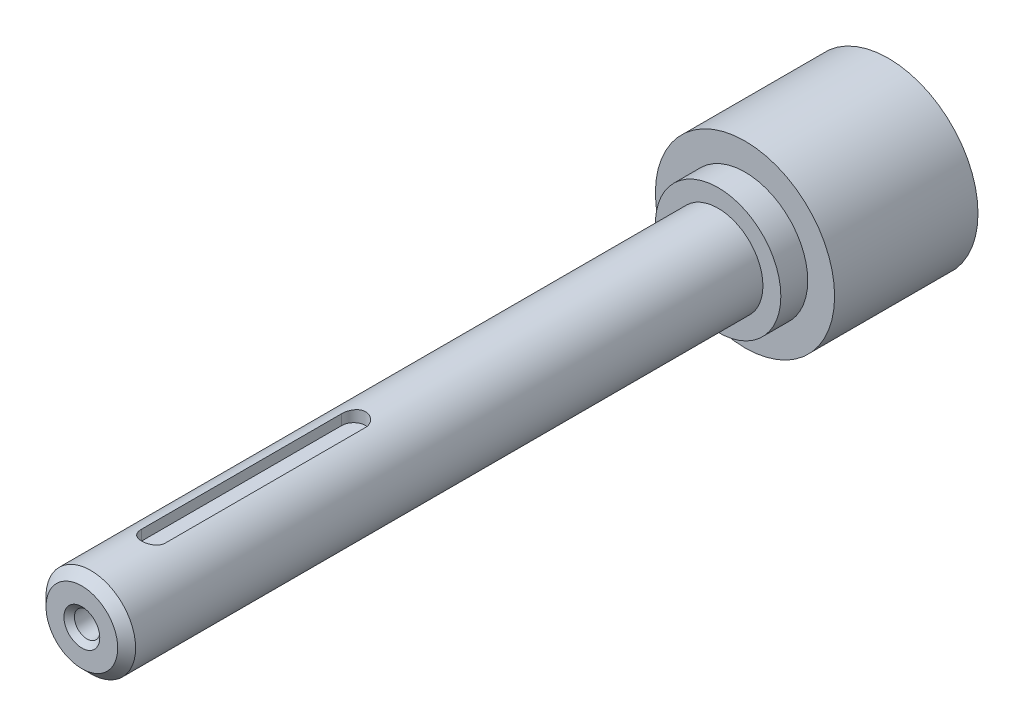
ISO-10303-21;
HEADER;
FILE_DESCRIPTION(('STEP AP214'),'2;1');
FILE_NAME('part.step','',(''),(''),'','','');
FILE_SCHEMA(('AUTOMOTIVE_DESIGN { 1 0 10303 214 1 1 1 1 }'));
ENDSEC;
DATA;
#1=APPLICATION_CONTEXT('core data for automotive mechanical design processes');
#2=APPLICATION_PROTOCOL_DEFINITION('international standard','automotive_design',2000,#1);
#3=PRODUCT_CONTEXT('',#1,'mechanical');
#4=PRODUCT('Part','Part','',(#3));
#5=PRODUCT_RELATED_PRODUCT_CATEGORY('part','',(#4));
#6=PRODUCT_DEFINITION_FORMATION('','',#4);
#7=PRODUCT_DEFINITION_CONTEXT('part definition',#1,'design');
#8=PRODUCT_DEFINITION('design','',#6,#7);
#9=PRODUCT_DEFINITION_SHAPE('','',#8);
#10=(LENGTH_UNIT() NAMED_UNIT(*) SI_UNIT(.MILLI.,.METRE.));
#11=(NAMED_UNIT(*) PLANE_ANGLE_UNIT() SI_UNIT($,.RADIAN.));
#12=(NAMED_UNIT(*) SI_UNIT($,.STERADIAN.) SOLID_ANGLE_UNIT());
#13=UNCERTAINTY_MEASURE_WITH_UNIT(LENGTH_MEASURE(1.E-05),#10,'distance_accuracy_value','');
#14=(GEOMETRIC_REPRESENTATION_CONTEXT(3) GLOBAL_UNCERTAINTY_ASSIGNED_CONTEXT((#13)) GLOBAL_UNIT_ASSIGNED_CONTEXT((#10,
#11,#12)) REPRESENTATION_CONTEXT('',''));
#15=CARTESIAN_POINT('',(0.,0.,0.));
#16=DIRECTION('',(0.,0.,1.));
#17=DIRECTION('',(1.,0.,0.));
#18=AXIS2_PLACEMENT_3D('',#15,#16,#17);
#19=CARTESIAN_POINT('',(0.,0.,-222.));
#20=DIRECTION('',(0.,0.,1.));
#21=DIRECTION('',(1.,0.,0.));
#22=AXIS2_PLACEMENT_3D('',#19,#20,#21);
#23=PLANE('',#22);
#24=CARTESIAN_POINT('',(0.,0.,-222.));
#25=DIRECTION('',(0.,0.,1.));
#26=DIRECTION('',(1.,0.,0.));
#27=AXIS2_PLACEMENT_3D('',#24,#25,#26);
#28=CIRCLE('',#27,30.);
#29=CARTESIAN_POINT('',(30.,0.,-222.));
#30=VERTEX_POINT('',#29);
#31=EDGE_CURVE('E116',#30,#30,#28,.T.);
#32=ORIENTED_EDGE('',*,*,#31,.T.);
#33=EDGE_LOOP('',(#32));
#34=FACE_BOUND('',#33,.T.);
#35=CARTESIAN_POINT('',(0.,0.,-222.));
#36=DIRECTION('',(0.,0.,1.));
#37=DIRECTION('',(1.,0.,0.));
#38=AXIS2_PLACEMENT_3D('',#35,#36,#37);
#39=CIRCLE('',#38,21.);
#40=CARTESIAN_POINT('',(21.,0.,-222.));
#41=VERTEX_POINT('',#40);
#42=EDGE_CURVE('E136',#41,#41,#39,.T.);
#43=ORIENTED_EDGE('',*,*,#42,.F.);
#44=EDGE_LOOP('',(#43));
#45=FACE_BOUND('',#44,.T.);
#46=ADVANCED_FACE('F40',(#34,#45),#23,.T.);
#47=CARTESIAN_POINT('',(0.,0.,0.));
#48=DIRECTION('',(0.,0.,1.));
#49=DIRECTION('',(1.,0.,0.));
#50=AXIS2_PLACEMENT_3D('',#47,#48,#49);
#51=CYLINDRICAL_SURFACE('',#50,21.);
#52=ORIENTED_EDGE('',*,*,#42,.T.);
#53=EDGE_LOOP('',(#52));
#54=FACE_BOUND('',#53,.T.);
#55=CARTESIAN_POINT('',(0.,0.,-213.));
#56=DIRECTION('',(0.,0.,1.));
#57=DIRECTION('',(1.,0.,0.));
#58=AXIS2_PLACEMENT_3D('',#55,#56,#57);
#59=CIRCLE('',#58,21.);
#60=CARTESIAN_POINT('',(21.,0.,-213.));
#61=VERTEX_POINT('',#60);
#62=EDGE_CURVE('E133',#61,#61,#59,.T.);
#63=ORIENTED_EDGE('',*,*,#62,.F.);
#64=EDGE_LOOP('',(#63));
#65=FACE_BOUND('',#64,.T.);
#66=ADVANCED_FACE('F201',(#54,#65),#51,.T.);
#67=CARTESIAN_POINT('',(0.,0.,-213.));
#68=DIRECTION('',(0.,0.,1.));
#69=DIRECTION('',(1.,0.,0.));
#70=AXIS2_PLACEMENT_3D('',#67,#68,#69);
#71=PLANE('',#70);
#72=ORIENTED_EDGE('',*,*,#62,.T.);
#73=EDGE_LOOP('',(#72));
#74=FACE_BOUND('',#73,.T.);
#75=CARTESIAN_POINT('',(0.,0.,-213.));
#76=DIRECTION('',(0.,0.,1.));
#77=DIRECTION('',(1.,0.,0.));
#78=AXIS2_PLACEMENT_3D('',#75,#76,#77);
#79=CIRCLE('',#78,15.);
#80=CARTESIAN_POINT('',(15.,0.,-213.));
#81=VERTEX_POINT('',#80);
#82=EDGE_CURVE('E130',#81,#81,#79,.T.);
#83=ORIENTED_EDGE('',*,*,#82,.F.);
#84=EDGE_LOOP('',(#83));
#85=FACE_BOUND('',#84,.T.);
#86=ADVANCED_FACE('F207',(#74,#85),#71,.T.);
#87=CARTESIAN_POINT('',(0.,0.,0.));
#88=DIRECTION('',(0.,0.,1.));
#89=DIRECTION('',(1.,0.,0.));
#90=AXIS2_PLACEMENT_3D('',#87,#88,#89);
#91=CYLINDRICAL_SURFACE('',#90,15.);
#92=CARTESIAN_POINT('',(0.,0.,-2.99999999999993));
#93=DIRECTION('',(0.,0.,1.));
#94=DIRECTION('',(1.,0.,0.));
#95=AXIS2_PLACEMENT_3D('',#92,#93,#94);
#96=CIRCLE('',#95,15.);
#97=CARTESIAN_POINT('',(15.,0.,-2.99999999999993));
#98=VERTEX_POINT('',#97);
#99=EDGE_CURVE('E183',#98,#98,#96,.F.);
#100=ORIENTED_EDGE('',*,*,#99,.T.);
#101=EDGE_LOOP('',(#100));
#102=FACE_BOUND('',#101,.T.);
#103=CARTESIAN_POINT('',(4.,14.456832294801,-91.));
#104=CARTESIAN_POINT('',(4.00001309389174,14.4568189842467,-91.1103582434041));
#105=CARTESIAN_POINT('',(3.99543311151603,14.4580956467717,-91.2207085219929));
#106=CARTESIAN_POINT('',(3.97718874589725,14.4631301353516,-91.4405786539661));
#107=CARTESIAN_POINT('',(3.96352604983924,14.4668875005959,-91.5500986577597));
#108=CARTESIAN_POINT('',(3.92725695741263,14.4767740441058,-91.767301653514));
#109=CARTESIAN_POINT('',(3.90466984692446,14.482898107258,-91.8749880878483));
#110=CARTESIAN_POINT('',(3.85076543838184,14.4973231400467,-92.0879748603556));
#111=CARTESIAN_POINT('',(3.81944798699437,14.5056241479174,-92.1932751565853));
#112=CARTESIAN_POINT('',(3.71275643853686,14.5334412456827,-92.5044634187753));
#113=CARTESIAN_POINT('',(3.62460332607936,14.5558829598252,-92.7058749335474));
#114=CARTESIAN_POINT('',(3.4169578047582,14.6060171290377,-93.0910207596257));
#115=CARTESIAN_POINT('',(3.29745504324307,14.6337113178035,-93.2747492039724));
#116=CARTESIAN_POINT('',(3.0273032087801,14.6920016406366,-93.6239705769278));
#117=CARTESIAN_POINT('',(2.87601544465619,14.7226489452442,-93.7889618409657));
#118=CARTESIAN_POINT('',(2.54795832924028,14.7829523618628,-94.0915575669617));
#119=CARTESIAN_POINT('',(2.37118484921248,14.8126083123117,-94.2291575828684));
#120=CARTESIAN_POINT('',(1.99367199592155,14.8681604116921,-94.4751721301854));
#121=CARTESIAN_POINT('',(1.79259414843396,14.8939887414057,-94.5830839655783));
#122=CARTESIAN_POINT('',(1.3743557555279,14.9383834129136,-94.7633728889613));
#123=CARTESIAN_POINT('',(1.15719869214846,14.9569513215518,-94.8357576447769));
#124=CARTESIAN_POINT('',(0.718234307369669,14.9843709217852,-94.9413098251693));
#125=CARTESIAN_POINT('',(0.496647293428103,14.9934353394137,-94.9753372128936));
#126=CARTESIAN_POINT('',(0.0507319917605735,15.0015705103632,-95.005914313223));
#127=CARTESIAN_POINT('',(-0.17359589196346,15.0006427191926,-95.0024694841925));
#128=CARTESIAN_POINT('',(-0.612629502642178,14.9890534931376,-94.9588043136318));
#129=CARTESIAN_POINT('',(-0.827435206418332,14.9786381919443,-94.9195138723437));
#130=CARTESIAN_POINT('',(-1.24728467665106,14.9495347795912,-94.8067748491367));
#131=CARTESIAN_POINT('',(-1.45232797980576,14.9308462762364,-94.7333246478493));
#132=CARTESIAN_POINT('',(-1.84920963545356,14.8869312076945,-94.5536400337472));
#133=CARTESIAN_POINT('',(-2.04089626466618,14.8616414267933,-94.4470866277702));
#134=CARTESIAN_POINT('',(-2.40398441957149,14.8072486052897,-94.2044572310353));
#135=CARTESIAN_POINT('',(-2.57538239000351,14.7781448982353,-94.0683760778169));
#136=CARTESIAN_POINT('',(-2.89854935036781,14.7182294237973,-93.7656720288986));
#137=CARTESIAN_POINT('',(-3.04955722400809,14.6873926412643,-93.5982419921057));
#138=CARTESIAN_POINT('',(-3.32161448391783,14.6282716207252,-93.2399571592908));
#139=CARTESIAN_POINT('',(-3.4426555807802,14.5999880903709,-93.0490959035188));
#140=CARTESIAN_POINT('',(-3.59932937334133,14.5618587427771,-92.7486467166354));
#141=CARTESIAN_POINT('',(-3.64754371945348,14.5498268172621,-92.645711084959));
#142=CARTESIAN_POINT('',(-3.73509417643326,14.5275984074125,-92.4359536787286));
#143=CARTESIAN_POINT('',(-3.77443385857863,14.5174011851057,-92.3291334875372));
#144=CARTESIAN_POINT('',(-3.843867838105,14.4991713081511,-92.1124805807798));
#145=CARTESIAN_POINT('',(-3.87397173088603,14.4911364080612,-92.002651121807));
#146=CARTESIAN_POINT('',(-3.92471856960774,14.4774747012191,-91.7807247788751));
#147=CARTESIAN_POINT('',(-3.9453659249532,14.4718467722231,-91.66862897718));
#148=CARTESIAN_POINT('',(-3.97411378733403,14.4639761334309,-91.463748975282));
#149=CARTESIAN_POINT('',(-3.98382319960777,14.4613012625133,-91.3712035538327));
#150=CARTESIAN_POINT('',(-3.99676420153356,14.4577275048596,-91.1857746466901));
#151=CARTESIAN_POINT('',(-4.00000603663184,14.4568258092259,-91.0928919295675));
#152=CARTESIAN_POINT('',(-4.,14.456832294801,-91.));
#153=B_SPLINE_CURVE_WITH_KNOTS('',3,(#103,#104,#105,#106,#107,#108,#109,#110,#111,#112,#113,
#114,#115,#116,#117,#118,#119,#120,#121,#122,#123,#124,#125,#126,#127,#128,#129,#130,#131,#132,
#133,#134,#135,#136,#137,#138,#139,#140,#141,#142,#143,#144,#145,#146,#147,#148,#149,#150,#151,
#152),.UNSPECIFIED.,.F.,.F.,(4,2,2,2,2,2,2,2,2,2,2,2,2,2,2,2,2,2,2,2,2,2,2,2,4),(0.,
0.330958670878037,0.66185588076851,0.992041890688566,1.32223370010826,1.9819070018718,
2.64179842357631,3.3164963753615,3.99130375261119,4.67691814590524,5.36238449759351,
6.03215661862343,6.7018311790669,7.35461236515046,8.00742449996359,8.66673340793704,
9.32615767867958,10.0057598785669,10.6855498604333,11.0281077435251,11.3705275300852,
11.7125903499581,12.0544935096115,12.3335333037377,12.6121307120356),.UNSPECIFIED.);
#154=CARTESIAN_POINT('',(4.,14.456832294801,-91.));
#155=VERTEX_POINT('',#154);
#156=CARTESIAN_POINT('',(-4.,14.456832294801,-91.));
#157=VERTEX_POINT('',#156);
#158=EDGE_CURVE('E139',#155,#157,#153,.T.);
#159=ORIENTED_EDGE('',*,*,#158,.F.);
#160=DIRECTION('',(0.,0.,1.));
#161=VECTOR('',#160,1.);
#162=CARTESIAN_POINT('',(4.,14.456832294801,0.));
#163=LINE('',#162,#161);
#164=CARTESIAN_POINT('',(4.,14.456832294801,-24.));
#165=VERTEX_POINT('',#164);
#166=EDGE_CURVE('E176',#165,#155,#163,.F.);
#167=ORIENTED_EDGE('',*,*,#166,.F.);
#168=CARTESIAN_POINT('',(-4.,14.456832294801,-24.));
#169=CARTESIAN_POINT('',(-4.00001309389174,14.4568189842467,-23.8896417565959));
#170=CARTESIAN_POINT('',(-3.99543311151603,14.4580956467717,-23.7792914780071));
#171=CARTESIAN_POINT('',(-3.97718874589725,14.4631301353517,-23.5594213460339));
#172=CARTESIAN_POINT('',(-3.96352604983924,14.4668875005959,-23.4499013422402));
#173=CARTESIAN_POINT('',(-3.92725695741263,14.4767740441058,-23.232698346486));
#174=CARTESIAN_POINT('',(-3.90466984692446,14.482898107258,-23.1250119121517));
#175=CARTESIAN_POINT('',(-3.85076543838184,14.4973231400467,-22.9120251396444));
#176=CARTESIAN_POINT('',(-3.81944798699437,14.5056241479174,-22.8067248434147));
#177=CARTESIAN_POINT('',(-3.71275643853686,14.5334412456827,-22.4955365812247));
#178=CARTESIAN_POINT('',(-3.62460332607936,14.5558829598252,-22.2941250664526));
#179=CARTESIAN_POINT('',(-3.4169578047582,14.6060171290377,-21.9089792403742));
#180=CARTESIAN_POINT('',(-3.29745504324306,14.6337113178035,-21.7252507960276));
#181=CARTESIAN_POINT('',(-3.0273032087801,14.6920016406366,-21.3760294230722));
#182=CARTESIAN_POINT('',(-2.87601544465619,14.7226489452442,-21.2110381590343));
#183=CARTESIAN_POINT('',(-2.54795832924029,14.7829523618628,-20.9084424330384));
#184=CARTESIAN_POINT('',(-2.37118484921249,14.8126083123117,-20.7708424171316));
#185=CARTESIAN_POINT('',(-1.99367199592156,14.8681604116921,-20.5248278698146));
#186=CARTESIAN_POINT('',(-1.79259414843396,14.8939887414057,-20.4169160344217));
#187=CARTESIAN_POINT('',(-1.37435575552791,14.9383834129136,-20.2366271110387));
#188=CARTESIAN_POINT('',(-1.15719869214847,14.9569513215518,-20.1642423552231));
#189=CARTESIAN_POINT('',(-0.718234307369676,14.9843709217852,-20.0586901748307));
#190=CARTESIAN_POINT('',(-0.49664729342811,14.9934353394137,-20.0246627871064));
#191=CARTESIAN_POINT('',(-0.0507319917605799,15.0015705103632,-19.994085686777));
#192=CARTESIAN_POINT('',(0.173595891963454,15.0006427191926,-19.9975305158075));
#193=CARTESIAN_POINT('',(0.612629502642171,14.9890534931376,-20.0411956863682));
#194=CARTESIAN_POINT('',(0.827435206418325,14.9786381919443,-20.0804861276563));
#195=CARTESIAN_POINT('',(1.24728467665105,14.9495347795912,-20.1932251508633));
#196=CARTESIAN_POINT('',(1.45232797980575,14.9308462762364,-20.2666753521507));
#197=CARTESIAN_POINT('',(1.84920963545355,14.8869312076945,-20.4463599662528));
#198=CARTESIAN_POINT('',(2.04089626466617,14.8616414267933,-20.5529133722298));
#199=CARTESIAN_POINT('',(2.40398441957148,14.8072486052897,-20.7955427689646));
#200=CARTESIAN_POINT('',(2.57538239000351,14.7781448982353,-20.9316239221831));
#201=CARTESIAN_POINT('',(2.8985493503678,14.7182294237973,-21.2343279711014));
#202=CARTESIAN_POINT('',(3.04955722400808,14.6873926412643,-21.4017580078943));
#203=CARTESIAN_POINT('',(3.32161448391783,14.6282716207252,-21.7600428407092));
#204=CARTESIAN_POINT('',(3.4426555807802,14.5999880903709,-21.9509040964812));
#205=CARTESIAN_POINT('',(3.59932937334133,14.5618587427771,-22.2513532833646));
#206=CARTESIAN_POINT('',(3.64754371945348,14.5498268172621,-22.354288915041));
#207=CARTESIAN_POINT('',(3.73509417643326,14.5275984074125,-22.5640463212715));
#208=CARTESIAN_POINT('',(3.77443385857864,14.5174011851057,-22.6708665124627));
#209=CARTESIAN_POINT('',(3.843867838105,14.4991713081511,-22.8875194192202));
#210=CARTESIAN_POINT('',(3.87397173088604,14.4911364080612,-22.997348878193));
#211=CARTESIAN_POINT('',(3.92471856960774,14.4774747012191,-23.2192752211249));
#212=CARTESIAN_POINT('',(3.9453659249532,14.4718467722231,-23.33137102282));
#213=CARTESIAN_POINT('',(3.97411378733402,14.4639761334309,-23.536251024718));
#214=CARTESIAN_POINT('',(3.98382319960777,14.4613012625133,-23.6287964461673));
#215=CARTESIAN_POINT('',(3.99676420153356,14.4577275048596,-23.8142253533099));
#216=CARTESIAN_POINT('',(4.00000603663184,14.4568258092259,-23.9071080704325));
#217=CARTESIAN_POINT('',(4.,14.456832294801,-24.));
#218=B_SPLINE_CURVE_WITH_KNOTS('',3,(#168,#169,#170,#171,#172,#173,#174,#175,#176,#177,#178,
#179,#180,#181,#182,#183,#184,#185,#186,#187,#188,#189,#190,#191,#192,#193,#194,#195,#196,#197,
#198,#199,#200,#201,#202,#203,#204,#205,#206,#207,#208,#209,#210,#211,#212,#213,#214,#215,#216,
#217),.UNSPECIFIED.,.F.,.F.,(4,2,2,2,2,2,2,2,2,2,2,2,2,2,2,2,2,2,2,2,2,2,2,2,4),(0.,
0.330958670878051,0.661855880768517,0.992041890688574,1.32223370010825,1.98190700187181,
2.64179842357631,3.31649637536149,3.99130375261118,4.67691814590523,5.3623844975935,
6.03215661862343,6.7018311790669,7.35461236515045,8.00742449996358,8.66673340793703,
9.32615767867957,10.0057598785669,10.6855498604333,11.0281077435251,11.3705275300852,
11.7125903499582,12.0544935096114,12.3335333037377,12.6121307120356),.UNSPECIFIED.);
#219=CARTESIAN_POINT('',(-4.,14.456832294801,-24.));
#220=VERTEX_POINT('',#219);
#221=EDGE_CURVE('E62',#220,#165,#218,.T.);
#222=ORIENTED_EDGE('',*,*,#221,.F.);
#223=DIRECTION('',(0.,0.,1.));
#224=VECTOR('',#223,1.);
#225=CARTESIAN_POINT('',(-4.,14.456832294801,0.));
#226=LINE('',#225,#224);
#227=EDGE_CURVE('E147',#157,#220,#226,.T.);
#228=ORIENTED_EDGE('',*,*,#227,.F.);
#229=EDGE_LOOP('',(#159,#167,#222,#228));
#230=FACE_BOUND('',#229,.T.);
#231=ORIENTED_EDGE('',*,*,#82,.T.);
#232=EDGE_LOOP('',(#231));
#233=FACE_BOUND('',#232,.T.);
#234=ADVANCED_FACE('F149',(#102,#230,#233),#91,.T.);
#235=CARTESIAN_POINT('',(0.,0.,0.));
#236=DIRECTION('',(0.,0.,1.));
#237=DIRECTION('',(1.,0.,0.));
#238=AXIS2_PLACEMENT_3D('',#235,#236,#237);
#239=PLANE('',#238);
#240=CARTESIAN_POINT('',(0.,0.,0.));
#241=DIRECTION('',(0.,0.,1.));
#242=DIRECTION('',(1.,0.,0.));
#243=AXIS2_PLACEMENT_3D('',#240,#241,#242);
#244=CIRCLE('',#243,12.0000000000001);
#245=CARTESIAN_POINT('',(12.0000000000001,0.,0.));
#246=VERTEX_POINT('',#245);
#247=EDGE_CURVE('E178',#246,#246,#244,.T.);
#248=ORIENTED_EDGE('',*,*,#247,.T.);
#249=EDGE_LOOP('',(#248));
#250=FACE_BOUND('',#249,.T.);
#251=CARTESIAN_POINT('',(0.,0.,0.));
#252=DIRECTION('',(0.,0.,1.));
#253=DIRECTION('',(1.,0.,0.));
#254=AXIS2_PLACEMENT_3D('',#251,#252,#253);
#255=CIRCLE('',#254,6.);
#256=CARTESIAN_POINT('',(6.,0.,0.));
#257=VERTEX_POINT('',#256);
#258=EDGE_CURVE('E101',#257,#257,#255,.T.);
#259=ORIENTED_EDGE('',*,*,#258,.F.);
#260=EDGE_LOOP('',(#259));
#261=FACE_BOUND('',#260,.T.);
#262=ADVANCED_FACE('F224',(#250,#261),#239,.T.);
#263=CARTESIAN_POINT('',(0.,0.,-237.));
#264=DIRECTION('',(0.,0.,-1.));
#265=DIRECTION('',(-1.,0.,0.));
#266=AXIS2_PLACEMENT_3D('',#263,#264,#265);
#267=PLANE('',#266);
#268=CARTESIAN_POINT('',(0.,0.,-237.));
#269=DIRECTION('',(0.,0.,1.));
#270=DIRECTION('',(1.,0.,0.));
#271=AXIS2_PLACEMENT_3D('',#268,#269,#270);
#272=CIRCLE('',#271,23.5);
#273=CARTESIAN_POINT('',(23.5,0.,-237.));
#274=VERTEX_POINT('',#273);
#275=EDGE_CURVE('E127',#274,#274,#272,.T.);
#276=ORIENTED_EDGE('',*,*,#275,.F.);
#277=EDGE_LOOP('',(#276));
#278=FACE_BOUND('',#277,.T.);
#279=ADVANCED_FACE('F219',(#278),#267,.T.);
#280=CARTESIAN_POINT('',(0.,0.,0.));
#281=DIRECTION('',(0.,0.,1.));
#282=DIRECTION('',(1.,0.,0.));
#283=AXIS2_PLACEMENT_3D('',#280,#281,#282);
#284=CYLINDRICAL_SURFACE('',#283,23.5);
#285=CARTESIAN_POINT('',(0.,0.,-269.));
#286=DIRECTION('',(0.,0.,-1.));
#287=DIRECTION('',(-1.,0.,0.));
#288=AXIS2_PLACEMENT_3D('',#285,#286,#287);
#289=CIRCLE('',#288,23.5);
#290=CARTESIAN_POINT('',(-23.5,0.,-269.));
#291=VERTEX_POINT('',#290);
#292=EDGE_CURVE('E11',#291,#291,#289,.T.);
#293=ORIENTED_EDGE('',*,*,#292,.T.);
#294=EDGE_LOOP('',(#293));
#295=FACE_BOUND('',#294,.T.);
#296=ORIENTED_EDGE('',*,*,#275,.T.);
#297=EDGE_LOOP('',(#296));
#298=FACE_BOUND('',#297,.T.);
#299=ADVANCED_FACE('F213',(#295,#298),#284,.F.);
#300=CARTESIAN_POINT('',(0.,0.,-270.));
#301=DIRECTION('',(0.,0.,-1.));
#302=DIRECTION('',(-1.,0.,0.));
#303=AXIS2_PLACEMENT_3D('',#300,#301,#302);
#304=PLANE('',#303);
#305=CARTESIAN_POINT('',(0.,0.,-270.));
#306=DIRECTION('',(0.,0.,-1.));
#307=DIRECTION('',(-1.,0.,0.));
#308=AXIS2_PLACEMENT_3D('',#305,#306,#307);
#309=CIRCLE('',#308,24.5);
#310=CARTESIAN_POINT('',(-24.5,0.,-270.));
#311=VERTEX_POINT('',#310);
#312=EDGE_CURVE('E48',#311,#311,#309,.F.);
#313=ORIENTED_EDGE('',*,*,#312,.T.);
#314=EDGE_LOOP('',(#313));
#315=FACE_BOUND('',#314,.T.);
#316=CARTESIAN_POINT('',(0.,0.,-270.));
#317=DIRECTION('',(0.,0.,-1.));
#318=DIRECTION('',(-1.,0.,0.));
#319=AXIS2_PLACEMENT_3D('',#316,#317,#318);
#320=CIRCLE('',#319,30.);
#321=CARTESIAN_POINT('',(-30.,0.,-270.));
#322=VERTEX_POINT('',#321);
#323=EDGE_CURVE('E126',#322,#322,#320,.F.);
#324=ORIENTED_EDGE('',*,*,#323,.F.);
#325=EDGE_LOOP('',(#324));
#326=FACE_BOUND('',#325,.T.);
#327=ADVANCED_FACE('F188',(#315,#326),#304,.T.);
#328=CARTESIAN_POINT('',(0.,0.,0.));
#329=DIRECTION('',(0.,0.,1.));
#330=DIRECTION('',(1.,0.,0.));
#331=AXIS2_PLACEMENT_3D('',#328,#329,#330);
#332=CYLINDRICAL_SURFACE('',#331,30.);
#333=ORIENTED_EDGE('',*,*,#323,.T.);
#334=EDGE_LOOP('',(#333));
#335=FACE_BOUND('',#334,.T.);
#336=ORIENTED_EDGE('',*,*,#31,.F.);
#337=EDGE_LOOP('',(#336));
#338=FACE_BOUND('',#337,.T.);
#339=ADVANCED_FACE('F168',(#335,#338),#332,.T.);
#340=CARTESIAN_POINT('',(0.,11.,-24.));
#341=DIRECTION('',(0.,1.,0.));
#342=DIRECTION('',(0.,0.,1.));
#343=AXIS2_PLACEMENT_3D('',#340,#341,#342);
#344=CYLINDRICAL_SURFACE('',#343,4.);
#345=DIRECTION('',(0.,1.,0.));
#346=VECTOR('',#345,1.);
#347=CARTESIAN_POINT('',(-4.,11.,-24.));
#348=LINE('',#347,#346);
#349=CARTESIAN_POINT('',(-4.,11.,-24.));
#350=VERTEX_POINT('',#349);
#351=EDGE_CURVE('E113',#350,#220,#348,.T.);
#352=ORIENTED_EDGE('',*,*,#351,.T.);
#353=ORIENTED_EDGE('',*,*,#221,.T.);
#354=DIRECTION('',(0.,1.,0.));
#355=VECTOR('',#354,1.);
#356=CARTESIAN_POINT('',(4.,11.,-24.));
#357=LINE('',#356,#355);
#358=CARTESIAN_POINT('',(4.,11.,-24.));
#359=VERTEX_POINT('',#358);
#360=EDGE_CURVE('E55',#359,#165,#357,.T.);
#361=ORIENTED_EDGE('',*,*,#360,.F.);
#362=CARTESIAN_POINT('',(0.,11.,-24.));
#363=DIRECTION('',(0.,1.,0.));
#364=DIRECTION('',(0.,0.,1.));
#365=AXIS2_PLACEMENT_3D('',#362,#363,#364);
#366=CIRCLE('',#365,4.);
#367=EDGE_CURVE('E94',#350,#359,#366,.T.);
#368=ORIENTED_EDGE('',*,*,#367,.F.);
#369=EDGE_LOOP('',(#352,#353,#361,#368));
#370=FACE_BOUND('',#369,.T.);
#371=ADVANCED_FACE('F164',(#370),#344,.F.);
#372=CARTESIAN_POINT('',(-4.,11.,-24.));
#373=DIRECTION('',(-1.,0.,0.));
#374=DIRECTION('',(0.,0.,1.));
#375=AXIS2_PLACEMENT_3D('',#372,#373,#374);
#376=PLANE('',#375);
#377=ORIENTED_EDGE('',*,*,#227,.T.);
#378=ORIENTED_EDGE('',*,*,#351,.F.);
#379=DIRECTION('',(0.,0.,1.));
#380=VECTOR('',#379,1.);
#381=CARTESIAN_POINT('',(-4.,11.,-24.));
#382=LINE('',#381,#380);
#383=CARTESIAN_POINT('',(-4.,11.,-91.));
#384=VERTEX_POINT('',#383);
#385=EDGE_CURVE('E110',#384,#350,#382,.T.);
#386=ORIENTED_EDGE('',*,*,#385,.F.);
#387=DIRECTION('',(0.,1.,0.));
#388=VECTOR('',#387,1.);
#389=CARTESIAN_POINT('',(-4.,11.,-91.));
#390=LINE('',#389,#388);
#391=EDGE_CURVE('E117',#384,#157,#390,.T.);
#392=ORIENTED_EDGE('',*,*,#391,.T.);
#393=EDGE_LOOP('',(#377,#378,#386,#392));
#394=FACE_BOUND('',#393,.T.);
#395=ADVANCED_FACE('F159',(#394),#376,.F.);
#396=CARTESIAN_POINT('',(0.,11.,-91.));
#397=DIRECTION('',(0.,1.,0.));
#398=DIRECTION('',(0.,0.,1.));
#399=AXIS2_PLACEMENT_3D('',#396,#397,#398);
#400=CYLINDRICAL_SURFACE('',#399,4.);
#401=DIRECTION('',(0.,1.,0.));
#402=VECTOR('',#401,1.);
#403=CARTESIAN_POINT('',(4.,11.,-91.));
#404=LINE('',#403,#402);
#405=CARTESIAN_POINT('',(4.,11.,-91.));
#406=VERTEX_POINT('',#405);
#407=EDGE_CURVE('E120',#406,#155,#404,.T.);
#408=ORIENTED_EDGE('',*,*,#407,.T.);
#409=ORIENTED_EDGE('',*,*,#158,.T.);
#410=ORIENTED_EDGE('',*,*,#391,.F.);
#411=CARTESIAN_POINT('',(0.,11.,-91.));
#412=DIRECTION('',(0.,1.,0.));
#413=DIRECTION('',(0.,0.,1.));
#414=AXIS2_PLACEMENT_3D('',#411,#412,#413);
#415=CIRCLE('',#414,4.);
#416=EDGE_CURVE('E107',#406,#384,#415,.T.);
#417=ORIENTED_EDGE('',*,*,#416,.F.);
#418=EDGE_LOOP('',(#408,#409,#410,#417));
#419=FACE_BOUND('',#418,.T.);
#420=ADVANCED_FACE('F153',(#419),#400,.F.);
#421=CARTESIAN_POINT('',(4.,11.,-24.));
#422=DIRECTION('',(1.,0.,0.));
#423=DIRECTION('',(0.,0.,-1.));
#424=AXIS2_PLACEMENT_3D('',#421,#422,#423);
#425=PLANE('',#424);
#426=ORIENTED_EDGE('',*,*,#166,.T.);
#427=ORIENTED_EDGE('',*,*,#407,.F.);
#428=DIRECTION('',(0.,0.,-1.));
#429=VECTOR('',#428,1.);
#430=CARTESIAN_POINT('',(4.,11.,-24.));
#431=LINE('',#430,#429);
#432=EDGE_CURVE('E98',#359,#406,#431,.T.);
#433=ORIENTED_EDGE('',*,*,#432,.F.);
#434=ORIENTED_EDGE('',*,*,#360,.T.);
#435=EDGE_LOOP('',(#426,#427,#433,#434));
#436=FACE_BOUND('',#435,.T.);
#437=ADVANCED_FACE('F158',(#436),#425,.F.);
#438=CARTESIAN_POINT('',(0.,11.,-24.));
#439=DIRECTION('',(0.,1.,0.));
#440=DIRECTION('',(0.,0.,1.));
#441=AXIS2_PLACEMENT_3D('',#438,#439,#440);
#442=PLANE('',#441);
#443=ORIENTED_EDGE('',*,*,#367,.T.);
#444=ORIENTED_EDGE('',*,*,#432,.T.);
#445=ORIENTED_EDGE('',*,*,#416,.T.);
#446=ORIENTED_EDGE('',*,*,#385,.T.);
#447=EDGE_LOOP('',(#443,#444,#445,#446));
#448=FACE_BOUND('',#447,.T.);
#449=ADVANCED_FACE('F88',(#448),#442,.T.);
#450=CARTESIAN_POINT('',(0.,0.,-24.5));
#451=DIRECTION('',(0.,0.,1.));
#452=DIRECTION('',(1.,0.,0.));
#453=AXIS2_PLACEMENT_3D('',#450,#451,#452);
#454=CONICAL_SURFACE('',#453,4.24999999999999,1.02974425867665);
#455=CARTESIAN_POINT('',(0.,0.,-27.0536576308671));
#456=VERTEX_POINT('',#455);
#457=VERTEX_LOOP('',#456);
#458=FACE_BOUND('',#457,.T.);
#459=CARTESIAN_POINT('',(0.,0.,-24.5));
#460=DIRECTION('',(0.,0.,1.));
#461=DIRECTION('',(1.,0.,0.));
#462=AXIS2_PLACEMENT_3D('',#459,#460,#461);
#463=CIRCLE('',#462,4.24999999999999);
#464=CARTESIAN_POINT('',(4.24999999999999,0.,-24.5));
#465=VERTEX_POINT('',#464);
#466=EDGE_CURVE('E92',#465,#465,#463,.T.);
#467=ORIENTED_EDGE('',*,*,#466,.T.);
#468=EDGE_LOOP('',(#467));
#469=FACE_BOUND('',#468,.T.);
#470=ADVANCED_FACE('F84',(#458,#469),#454,.F.);
#471=CARTESIAN_POINT('',(0.,0.,0.));
#472=DIRECTION('',(0.,0.,1.));
#473=DIRECTION('',(1.,0.,0.));
#474=AXIS2_PLACEMENT_3D('',#471,#472,#473);
#475=CYLINDRICAL_SURFACE('',#474,4.24999999999999);
#476=ORIENTED_EDGE('',*,*,#466,.F.);
#477=EDGE_LOOP('',(#476));
#478=FACE_BOUND('',#477,.T.);
#479=CARTESIAN_POINT('',(0.,0.,-1.75));
#480=DIRECTION('',(0.,0.,1.));
#481=DIRECTION('',(1.,0.,0.));
#482=AXIS2_PLACEMENT_3D('',#479,#480,#481);
#483=CIRCLE('',#482,4.25);
#484=CARTESIAN_POINT('',(4.25,0.,-1.75));
#485=VERTEX_POINT('',#484);
#486=EDGE_CURVE('E95',#485,#485,#483,.T.);
#487=ORIENTED_EDGE('',*,*,#486,.T.);
#488=EDGE_LOOP('',(#487));
#489=FACE_BOUND('',#488,.T.);
#490=ADVANCED_FACE('F87',(#478,#489),#475,.F.);
#491=CARTESIAN_POINT('',(0.,0.,0.));
#492=DIRECTION('',(0.,0.,1.));
#493=DIRECTION('',(1.,0.,0.));
#494=AXIS2_PLACEMENT_3D('',#491,#492,#493);
#495=CONICAL_SURFACE('',#494,6.,0.785398163397448);
#496=ORIENTED_EDGE('',*,*,#486,.F.);
#497=EDGE_LOOP('',(#496));
#498=FACE_BOUND('',#497,.T.);
#499=ORIENTED_EDGE('',*,*,#258,.T.);
#500=EDGE_LOOP('',(#499));
#501=FACE_BOUND('',#500,.T.);
#502=ADVANCED_FACE('F197',(#498,#501),#495,.F.);
#503=CARTESIAN_POINT('',(0.,0.,0.));
#504=DIRECTION('',(0.,0.,-1.));
#505=DIRECTION('',(-1.,0.,0.));
#506=AXIS2_PLACEMENT_3D('',#503,#504,#505);
#507=CONICAL_SURFACE('',#506,12.0000000000001,0.785398163397449);
#508=ORIENTED_EDGE('',*,*,#99,.F.);
#509=EDGE_LOOP('',(#508));
#510=FACE_BOUND('',#509,.T.);
#511=ORIENTED_EDGE('',*,*,#247,.F.);
#512=EDGE_LOOP('',(#511));
#513=FACE_BOUND('',#512,.T.);
#514=ADVANCED_FACE('F192',(#510,#513),#507,.T.);
#515=CARTESIAN_POINT('',(0.,0.,-270.));
#516=DIRECTION('',(0.,0.,-1.));
#517=DIRECTION('',(-1.,0.,0.));
#518=AXIS2_PLACEMENT_3D('',#515,#516,#517);
#519=CONICAL_SURFACE('',#518,24.5,0.785398163397445);
#520=ORIENTED_EDGE('',*,*,#292,.F.);
#521=EDGE_LOOP('',(#520));
#522=FACE_BOUND('',#521,.T.);
#523=ORIENTED_EDGE('',*,*,#312,.F.);
#524=EDGE_LOOP('',(#523));
#525=FACE_BOUND('',#524,.T.);
#526=ADVANCED_FACE('F42',(#522,#525),#519,.F.);
#527=CLOSED_SHELL('',(#46,#66,#86,#234,#262,#279,#299,#327,#339,#371,#395,#420,#437,#449,#470,
#490,#502,#514,#526));
#528=MANIFOLD_SOLID_BREP('B2',#527);
#529=ADVANCED_BREP_SHAPE_REPRESENTATION('',(#18,#528),#14);
#530=SHAPE_DEFINITION_REPRESENTATION(#9,#529);
ENDSEC;
END-ISO-10303-21;
